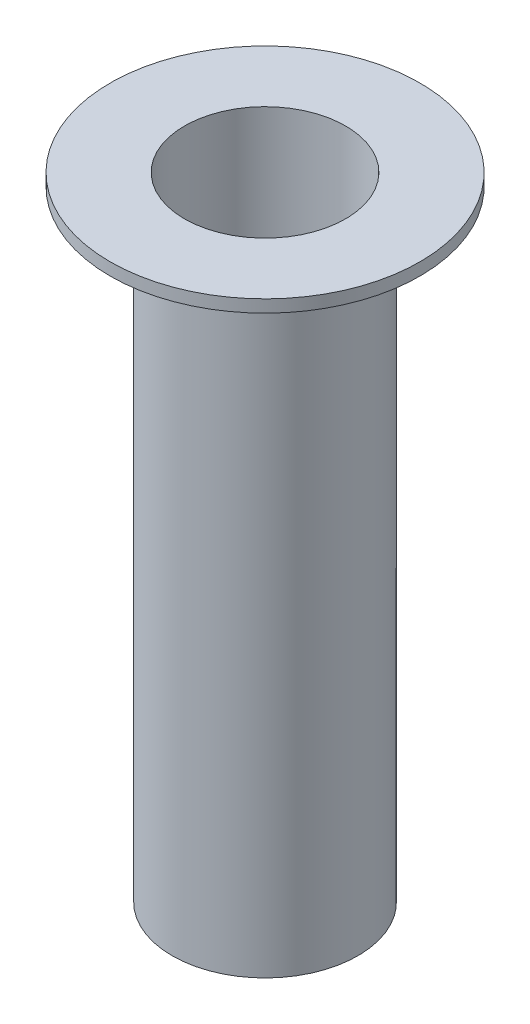
ISO-10303-21;
HEADER;
FILE_DESCRIPTION(('STEP AP214'),'2;1');
FILE_NAME('part.step','',(''),(''),'','','');
FILE_SCHEMA(('AUTOMOTIVE_DESIGN { 1 0 10303 214 1 1 1 1 }'));
ENDSEC;
DATA;
#1=APPLICATION_CONTEXT('core data for automotive mechanical design processes');
#2=APPLICATION_PROTOCOL_DEFINITION('international standard','automotive_design',2000,#1);
#3=PRODUCT_CONTEXT('',#1,'mechanical');
#4=PRODUCT('Part','Part','',(#3));
#5=PRODUCT_RELATED_PRODUCT_CATEGORY('part','',(#4));
#6=PRODUCT_DEFINITION_FORMATION('','',#4);
#7=PRODUCT_DEFINITION_CONTEXT('part definition',#1,'design');
#8=PRODUCT_DEFINITION('design','',#6,#7);
#9=PRODUCT_DEFINITION_SHAPE('','',#8);
#10=(LENGTH_UNIT() NAMED_UNIT(*) SI_UNIT(.MILLI.,.METRE.));
#11=(NAMED_UNIT(*) PLANE_ANGLE_UNIT() SI_UNIT($,.RADIAN.));
#12=(NAMED_UNIT(*) SI_UNIT($,.STERADIAN.) SOLID_ANGLE_UNIT());
#13=UNCERTAINTY_MEASURE_WITH_UNIT(LENGTH_MEASURE(1.E-05),#10,'distance_accuracy_value','');
#14=(GEOMETRIC_REPRESENTATION_CONTEXT(3) GLOBAL_UNCERTAINTY_ASSIGNED_CONTEXT((#13)) GLOBAL_UNIT_ASSIGNED_CONTEXT((#10,
#11,#12)) REPRESENTATION_CONTEXT('',''));
#15=CARTESIAN_POINT('',(0.,0.,0.));
#16=DIRECTION('',(0.,0.,1.));
#17=DIRECTION('',(1.,0.,0.));
#18=AXIS2_PLACEMENT_3D('',#15,#16,#17);
#19=CARTESIAN_POINT('',(0.,-20.,0.));
#20=DIRECTION('',(0.,1.,0.));
#21=DIRECTION('',(0.,0.,1.));
#22=AXIS2_PLACEMENT_3D('',#19,#20,#21);
#23=PLANE('',#22);
#24=CARTESIAN_POINT('',(0.,-20.,0.));
#25=DIRECTION('',(0.,1.,0.));
#26=DIRECTION('',(0.,0.,1.));
#27=AXIS2_PLACEMENT_3D('',#24,#25,#26);
#28=CIRCLE('',#27,6.);
#29=CARTESIAN_POINT('',(0.,-20.,6.));
#30=VERTEX_POINT('',#29);
#31=EDGE_CURVE('E35',#30,#30,#28,.T.);
#32=ORIENTED_EDGE('',*,*,#31,.F.);
#33=EDGE_LOOP('',(#32));
#34=FACE_BOUND('',#33,.T.);
#35=CARTESIAN_POINT('',(0.,-20.,0.));
#36=DIRECTION('',(0.,1.,0.));
#37=DIRECTION('',(0.,0.,1.));
#38=AXIS2_PLACEMENT_3D('',#35,#36,#37);
#39=CIRCLE('',#38,5.2);
#40=CARTESIAN_POINT('',(0.,-20.,5.2));
#41=VERTEX_POINT('',#40);
#42=EDGE_CURVE('E42',#41,#41,#39,.T.);
#43=ORIENTED_EDGE('',*,*,#42,.T.);
#44=EDGE_LOOP('',(#43));
#45=FACE_BOUND('',#44,.T.);
#46=ADVANCED_FACE('F31',(#34,#45),#23,.F.);
#47=CARTESIAN_POINT('',(0.,20.,0.));
#48=DIRECTION('',(0.,-1.,0.));
#49=DIRECTION('',(0.,0.,-1.));
#50=AXIS2_PLACEMENT_3D('',#47,#48,#49);
#51=CYLINDRICAL_SURFACE('',#50,6.);
#52=CARTESIAN_POINT('',(0.,20.,0.));
#53=DIRECTION('',(0.,1.,0.));
#54=DIRECTION('',(0.,0.,1.));
#55=AXIS2_PLACEMENT_3D('',#52,#53,#54);
#56=CIRCLE('',#55,6.);
#57=CARTESIAN_POINT('',(0.,20.,6.));
#58=VERTEX_POINT('',#57);
#59=EDGE_CURVE('E10',#58,#58,#56,.T.);
#60=ORIENTED_EDGE('',*,*,#59,.F.);
#61=EDGE_LOOP('',(#60));
#62=FACE_BOUND('',#61,.T.);
#63=ORIENTED_EDGE('',*,*,#31,.T.);
#64=EDGE_LOOP('',(#63));
#65=FACE_BOUND('',#64,.T.);
#66=ADVANCED_FACE('F33',(#62,#65),#51,.T.);
#67=CARTESIAN_POINT('',(0.,20.,0.));
#68=DIRECTION('',(0.,-1.,0.));
#69=DIRECTION('',(0.,0.,-1.));
#70=AXIS2_PLACEMENT_3D('',#67,#68,#69);
#71=CYLINDRICAL_SURFACE('',#70,5.2);
#72=ORIENTED_EDGE('',*,*,#42,.F.);
#73=EDGE_LOOP('',(#72));
#74=FACE_BOUND('',#73,.T.);
#75=CARTESIAN_POINT('',(0.,20.8,0.));
#76=DIRECTION('',(0.,1.,0.));
#77=DIRECTION('',(0.,0.,1.));
#78=AXIS2_PLACEMENT_3D('',#75,#76,#77);
#79=CIRCLE('',#78,5.2);
#80=CARTESIAN_POINT('',(0.,20.8,5.2));
#81=VERTEX_POINT('',#80);
#82=EDGE_CURVE('E50',#81,#81,#79,.T.);
#83=ORIENTED_EDGE('',*,*,#82,.T.);
#84=EDGE_LOOP('',(#83));
#85=FACE_BOUND('',#84,.T.);
#86=ADVANCED_FACE('F56',(#74,#85),#71,.F.);
#87=CARTESIAN_POINT('',(0.,20.8,0.));
#88=DIRECTION('',(0.,1.,0.));
#89=DIRECTION('',(0.,0.,1.));
#90=AXIS2_PLACEMENT_3D('',#87,#88,#89);
#91=PLANE('',#90);
#92=CARTESIAN_POINT('',(0.,20.8,0.));
#93=DIRECTION('',(0.,1.,0.));
#94=DIRECTION('',(0.,0.,1.));
#95=AXIS2_PLACEMENT_3D('',#92,#93,#94);
#96=CIRCLE('',#95,10.);
#97=CARTESIAN_POINT('',(0.,20.8,10.));
#98=VERTEX_POINT('',#97);
#99=EDGE_CURVE('E46',#98,#98,#96,.T.);
#100=ORIENTED_EDGE('',*,*,#99,.T.);
#101=EDGE_LOOP('',(#100));
#102=FACE_BOUND('',#101,.T.);
#103=ORIENTED_EDGE('',*,*,#82,.F.);
#104=EDGE_LOOP('',(#103));
#105=FACE_BOUND('',#104,.T.);
#106=ADVANCED_FACE('F58',(#102,#105),#91,.T.);
#107=CARTESIAN_POINT('',(0.,20.,0.));
#108=DIRECTION('',(0.,1.,0.));
#109=DIRECTION('',(0.,0.,1.));
#110=AXIS2_PLACEMENT_3D('',#107,#108,#109);
#111=PLANE('',#110);
#112=ORIENTED_EDGE('',*,*,#59,.T.);
#113=EDGE_LOOP('',(#112));
#114=FACE_BOUND('',#113,.T.);
#115=CARTESIAN_POINT('',(0.,20.,0.));
#116=DIRECTION('',(0.,1.,0.));
#117=DIRECTION('',(0.,0.,1.));
#118=AXIS2_PLACEMENT_3D('',#115,#116,#117);
#119=CIRCLE('',#118,10.);
#120=CARTESIAN_POINT('',(0.,20.,10.));
#121=VERTEX_POINT('',#120);
#122=EDGE_CURVE('E47',#121,#121,#119,.T.);
#123=ORIENTED_EDGE('',*,*,#122,.F.);
#124=EDGE_LOOP('',(#123));
#125=FACE_BOUND('',#124,.T.);
#126=ADVANCED_FACE('F60',(#114,#125),#111,.F.);
#127=CARTESIAN_POINT('',(0.,20.8,0.));
#128=DIRECTION('',(0.,-1.,0.));
#129=DIRECTION('',(0.,0.,-1.));
#130=AXIS2_PLACEMENT_3D('',#127,#128,#129);
#131=CYLINDRICAL_SURFACE('',#130,10.);
#132=ORIENTED_EDGE('',*,*,#99,.F.);
#133=EDGE_LOOP('',(#132));
#134=FACE_BOUND('',#133,.T.);
#135=ORIENTED_EDGE('',*,*,#122,.T.);
#136=EDGE_LOOP('',(#135));
#137=FACE_BOUND('',#136,.T.);
#138=ADVANCED_FACE('F67',(#134,#137),#131,.T.);
#139=CLOSED_SHELL('',(#46,#66,#86,#106,#126,#138));
#140=MANIFOLD_SOLID_BREP('B2',#139);
#141=ADVANCED_BREP_SHAPE_REPRESENTATION('',(#18,#140),#14);
#142=SHAPE_DEFINITION_REPRESENTATION(#9,#141);
ENDSEC;
END-ISO-10303-21;
